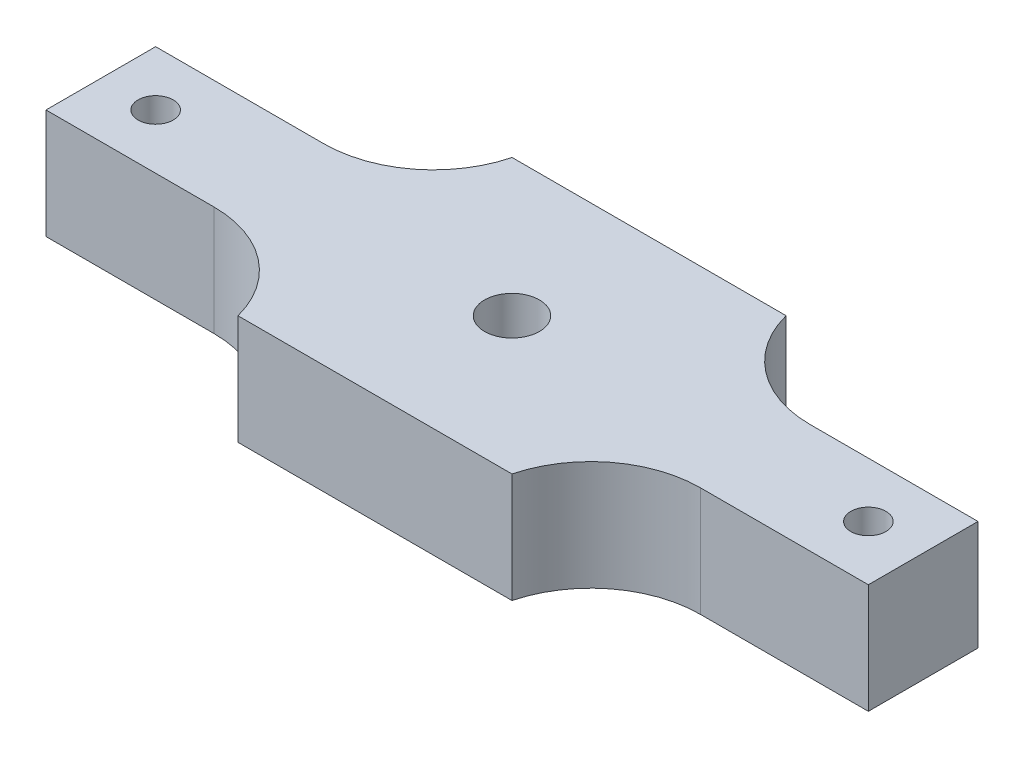
ISO-10303-21;
HEADER;
FILE_DESCRIPTION(('STEP AP214'),'2;1');
FILE_NAME('part.step','',(''),(''),'','','');
FILE_SCHEMA(('AUTOMOTIVE_DESIGN { 1 0 10303 214 1 1 1 1 }'));
ENDSEC;
DATA;
#1=APPLICATION_CONTEXT('core data for automotive mechanical design processes');
#2=APPLICATION_PROTOCOL_DEFINITION('international standard','automotive_design',2000,#1);
#3=PRODUCT_CONTEXT('',#1,'mechanical');
#4=PRODUCT('Part','Part','',(#3));
#5=PRODUCT_RELATED_PRODUCT_CATEGORY('part','',(#4));
#6=PRODUCT_DEFINITION_FORMATION('','',#4);
#7=PRODUCT_DEFINITION_CONTEXT('part definition',#1,'design');
#8=PRODUCT_DEFINITION('design','',#6,#7);
#9=PRODUCT_DEFINITION_SHAPE('','',#8);
#10=(LENGTH_UNIT() NAMED_UNIT(*) SI_UNIT(.MILLI.,.METRE.));
#11=(NAMED_UNIT(*) PLANE_ANGLE_UNIT() SI_UNIT($,.RADIAN.));
#12=(NAMED_UNIT(*) SI_UNIT($,.STERADIAN.) SOLID_ANGLE_UNIT());
#13=UNCERTAINTY_MEASURE_WITH_UNIT(LENGTH_MEASURE(1.E-05),#10,'distance_accuracy_value','');
#14=(GEOMETRIC_REPRESENTATION_CONTEXT(3) GLOBAL_UNCERTAINTY_ASSIGNED_CONTEXT((#13)) GLOBAL_UNIT_ASSIGNED_CONTEXT((#10,
#11,#12)) REPRESENTATION_CONTEXT('',''));
#15=CARTESIAN_POINT('',(0.,0.,0.));
#16=DIRECTION('',(0.,0.,1.));
#17=DIRECTION('',(1.,0.,0.));
#18=AXIS2_PLACEMENT_3D('',#15,#16,#17);
#19=CARTESIAN_POINT('',(0.,5.,16.0911769862675));
#20=DIRECTION('',(0.,0.,-1.));
#21=DIRECTION('',(-1.,0.,0.));
#22=AXIS2_PLACEMENT_3D('',#19,#20,#21);
#23=PLANE('',#22);
#24=DIRECTION('',(1.,0.,0.));
#25=VECTOR('',#24,1.);
#26=CARTESIAN_POINT('',(0.,-5.,16.0911769862675));
#27=LINE('',#26,#25);
#28=CARTESIAN_POINT('',(-55.4594317664236,-5.,16.0911769862675));
#29=VERTEX_POINT('',#28);
#30=CARTESIAN_POINT('',(-40.1342882080935,-5.,16.0911769862675));
#31=VERTEX_POINT('',#30);
#32=EDGE_CURVE('E273',#29,#31,#27,.T.);
#33=ORIENTED_EDGE('',*,*,#32,.T.);
#34=DIRECTION('',(0.,1.,0.));
#35=VECTOR('',#34,1.);
#36=CARTESIAN_POINT('',(-40.1342882080935,5.,16.0911769862675));
#37=LINE('',#36,#35);
#38=CARTESIAN_POINT('',(-40.1342882080935,5.,16.0911769862675));
#39=VERTEX_POINT('',#38);
#40=EDGE_CURVE('E163',#31,#39,#37,.T.);
#41=ORIENTED_EDGE('',*,*,#40,.T.);
#42=DIRECTION('',(1.,0.,0.));
#43=VECTOR('',#42,1.);
#44=CARTESIAN_POINT('',(0.,5.,16.0911769862675));
#45=LINE('',#44,#43);
#46=CARTESIAN_POINT('',(-55.4594317664236,5.,16.0911769862675));
#47=VERTEX_POINT('',#46);
#48=EDGE_CURVE('E136',#47,#39,#45,.T.);
#49=ORIENTED_EDGE('',*,*,#48,.F.);
#50=DIRECTION('',(0.,-1.,0.));
#51=VECTOR('',#50,1.);
#52=CARTESIAN_POINT('',(-55.4594317664236,5.,16.0911769862675));
#53=LINE('',#52,#51);
#54=EDGE_CURVE('E217',#47,#29,#53,.T.);
#55=ORIENTED_EDGE('',*,*,#54,.T.);
#56=EDGE_LOOP('',(#33,#41,#49,#55));
#57=FACE_BOUND('',#56,.T.);
#58=ADVANCED_FACE('F41',(#57),#23,.F.);
#59=CARTESIAN_POINT('',(0.,5.,23.5911769862675));
#60=DIRECTION('',(0.,0.,-1.));
#61=DIRECTION('',(-1.,0.,0.));
#62=AXIS2_PLACEMENT_3D('',#59,#60,#61);
#63=PLANE('',#62);
#64=DIRECTION('',(1.,0.,0.));
#65=VECTOR('',#64,1.);
#66=CARTESIAN_POINT('',(0.,-5.,23.5911769862675));
#67=LINE('',#66,#65);
#68=CARTESIAN_POINT('',(-30.451829842575,-5.,23.5911769862675));
#69=VERTEX_POINT('',#68);
#70=CARTESIAN_POINT('',(-5.45943176642362,-5.,23.5911769862675));
#71=VERTEX_POINT('',#70);
#72=EDGE_CURVE('E245',#69,#71,#67,.T.);
#73=ORIENTED_EDGE('',*,*,#72,.T.);
#74=DIRECTION('',(0.,-1.,0.));
#75=VECTOR('',#74,1.);
#76=CARTESIAN_POINT('',(-5.45943176642362,5.,23.5911769862675));
#77=LINE('',#76,#75);
#78=CARTESIAN_POINT('',(-5.45943176642362,5.,23.5911769862675));
#79=VERTEX_POINT('',#78);
#80=EDGE_CURVE('E151',#79,#71,#77,.T.);
#81=ORIENTED_EDGE('',*,*,#80,.F.);
#82=DIRECTION('',(1.,0.,0.));
#83=VECTOR('',#82,1.);
#84=CARTESIAN_POINT('',(0.,5.,23.5911769862675));
#85=LINE('',#84,#83);
#86=CARTESIAN_POINT('',(-30.451829842575,5.,23.5911769862675));
#87=VERTEX_POINT('',#86);
#88=EDGE_CURVE('E133',#87,#79,#85,.T.);
#89=ORIENTED_EDGE('',*,*,#88,.F.);
#90=DIRECTION('',(0.,-1.,0.));
#91=VECTOR('',#90,1.);
#92=CARTESIAN_POINT('',(-30.451829842575,5.,23.5911769862675));
#93=LINE('',#92,#91);
#94=EDGE_CURVE('E148',#87,#69,#93,.T.);
#95=ORIENTED_EDGE('',*,*,#94,.T.);
#96=EDGE_LOOP('',(#73,#81,#89,#95));
#97=FACE_BOUND('',#96,.T.);
#98=ADVANCED_FACE('F147',(#97),#63,.F.);
#99=CARTESIAN_POINT('',(0.,5.,16.0911769862675));
#100=DIRECTION('',(0.,0.,-1.));
#101=DIRECTION('',(-1.,0.,0.));
#102=AXIS2_PLACEMENT_3D('',#99,#100,#101);
#103=PLANE('',#102);
#104=DIRECTION('',(1.,0.,0.));
#105=VECTOR('',#104,1.);
#106=CARTESIAN_POINT('',(0.,5.,16.0911769862675));
#107=LINE('',#106,#105);
#108=CARTESIAN_POINT('',(4.22302659909492,5.,16.0911769862675));
#109=VERTEX_POINT('',#108);
#110=CARTESIAN_POINT('',(19.5405682335764,5.,16.0911769862675));
#111=VERTEX_POINT('',#110);
#112=EDGE_CURVE('E154',#109,#111,#107,.T.);
#113=ORIENTED_EDGE('',*,*,#112,.F.);
#114=DIRECTION('',(0.,1.,0.));
#115=VECTOR('',#114,1.);
#116=CARTESIAN_POINT('',(4.22302659909492,5.,16.0911769862675));
#117=LINE('',#116,#115);
#118=CARTESIAN_POINT('',(4.22302659909492,-5.,16.0911769862675));
#119=VERTEX_POINT('',#118);
#120=EDGE_CURVE('E158',#109,#119,#117,.F.);
#121=ORIENTED_EDGE('',*,*,#120,.T.);
#122=DIRECTION('',(1.,0.,0.));
#123=VECTOR('',#122,1.);
#124=CARTESIAN_POINT('',(0.,-5.,16.0911769862675));
#125=LINE('',#124,#123);
#126=CARTESIAN_POINT('',(19.5405682335764,-5.,16.0911769862675));
#127=VERTEX_POINT('',#126);
#128=EDGE_CURVE('E238',#119,#127,#125,.T.);
#129=ORIENTED_EDGE('',*,*,#128,.T.);
#130=DIRECTION('',(0.,-1.,0.));
#131=VECTOR('',#130,1.);
#132=CARTESIAN_POINT('',(19.5405682335764,5.,16.0911769862675));
#133=LINE('',#132,#131);
#134=EDGE_CURVE('E165',#111,#127,#133,.T.);
#135=ORIENTED_EDGE('',*,*,#134,.F.);
#136=EDGE_LOOP('',(#113,#121,#129,#135));
#137=FACE_BOUND('',#136,.T.);
#138=ADVANCED_FACE('F280',(#137),#103,.F.);
#139=CARTESIAN_POINT('',(19.5405682335764,5.,0.));
#140=DIRECTION('',(1.,0.,0.));
#141=DIRECTION('',(0.,0.,-1.));
#142=AXIS2_PLACEMENT_3D('',#139,#140,#141);
#143=PLANE('',#142);
#144=DIRECTION('',(0.,0.,1.));
#145=VECTOR('',#144,1.);
#146=CARTESIAN_POINT('',(19.5405682335764,-5.,0.));
#147=LINE('',#146,#145);
#148=CARTESIAN_POINT('',(19.5405682335764,-5.,6.0911769862675));
#149=VERTEX_POINT('',#148);
#150=EDGE_CURVE('E232',#149,#127,#147,.T.);
#151=ORIENTED_EDGE('',*,*,#150,.F.);
#152=DIRECTION('',(0.,-1.,0.));
#153=VECTOR('',#152,1.);
#154=CARTESIAN_POINT('',(19.5405682335764,5.,6.0911769862675));
#155=LINE('',#154,#153);
#156=CARTESIAN_POINT('',(19.5405682335764,5.,6.0911769862675));
#157=VERTEX_POINT('',#156);
#158=EDGE_CURVE('E215',#157,#149,#155,.T.);
#159=ORIENTED_EDGE('',*,*,#158,.F.);
#160=DIRECTION('',(0.,0.,1.));
#161=VECTOR('',#160,1.);
#162=CARTESIAN_POINT('',(19.5405682335764,5.,0.));
#163=LINE('',#162,#161);
#164=EDGE_CURVE('E234',#157,#111,#163,.T.);
#165=ORIENTED_EDGE('',*,*,#164,.T.);
#166=ORIENTED_EDGE('',*,*,#134,.T.);
#167=EDGE_LOOP('',(#151,#159,#165,#166));
#168=FACE_BOUND('',#167,.T.);
#169=ADVANCED_FACE('F230',(#168),#143,.T.);
#170=CARTESIAN_POINT('',(0.,5.,6.0911769862675));
#171=DIRECTION('',(0.,0.,-1.));
#172=DIRECTION('',(-1.,0.,0.));
#173=AXIS2_PLACEMENT_3D('',#170,#171,#172);
#174=PLANE('',#173);
#175=DIRECTION('',(1.,0.,0.));
#176=VECTOR('',#175,1.);
#177=CARTESIAN_POINT('',(0.,-5.,6.0911769862675));
#178=LINE('',#177,#176);
#179=CARTESIAN_POINT('',(4.22302659909492,-5.,6.0911769862675));
#180=VERTEX_POINT('',#179);
#181=EDGE_CURVE('E208',#180,#149,#178,.T.);
#182=ORIENTED_EDGE('',*,*,#181,.F.);
#183=DIRECTION('',(0.,-1.,0.));
#184=VECTOR('',#183,1.);
#185=CARTESIAN_POINT('',(4.22302659909492,5.,6.0911769862675));
#186=LINE('',#185,#184);
#187=CARTESIAN_POINT('',(4.22302659909492,5.,6.0911769862675));
#188=VERTEX_POINT('',#187);
#189=EDGE_CURVE('E171',#180,#188,#186,.F.);
#190=ORIENTED_EDGE('',*,*,#189,.T.);
#191=DIRECTION('',(1.,0.,0.));
#192=VECTOR('',#191,1.);
#193=CARTESIAN_POINT('',(0.,5.,6.0911769862675));
#194=LINE('',#193,#192);
#195=EDGE_CURVE('E284',#188,#157,#194,.T.);
#196=ORIENTED_EDGE('',*,*,#195,.T.);
#197=ORIENTED_EDGE('',*,*,#158,.T.);
#198=EDGE_LOOP('',(#182,#190,#196,#197));
#199=FACE_BOUND('',#198,.T.);
#200=ADVANCED_FACE('F295',(#199),#174,.T.);
#201=CARTESIAN_POINT('',(0.,5.,-1.4088230137325));
#202=DIRECTION('',(0.,0.,-1.));
#203=DIRECTION('',(-1.,0.,0.));
#204=AXIS2_PLACEMENT_3D('',#201,#202,#203);
#205=PLANE('',#204);
#206=DIRECTION('',(1.,0.,0.));
#207=VECTOR('',#206,1.);
#208=CARTESIAN_POINT('',(0.,-5.,-1.4088230137325));
#209=LINE('',#208,#207);
#210=CARTESIAN_POINT('',(-30.451829842575,-5.,-1.4088230137325));
#211=VERTEX_POINT('',#210);
#212=CARTESIAN_POINT('',(-5.45943176642363,-5.,-1.4088230137325));
#213=VERTEX_POINT('',#212);
#214=EDGE_CURVE('E196',#211,#213,#209,.T.);
#215=ORIENTED_EDGE('',*,*,#214,.F.);
#216=DIRECTION('',(0.,-1.,0.));
#217=VECTOR('',#216,1.);
#218=CARTESIAN_POINT('',(-30.451829842575,5.,-1.4088230137325));
#219=LINE('',#218,#217);
#220=CARTESIAN_POINT('',(-30.451829842575,5.,-1.4088230137325));
#221=VERTEX_POINT('',#220);
#222=EDGE_CURVE('E204',#221,#211,#219,.T.);
#223=ORIENTED_EDGE('',*,*,#222,.F.);
#224=DIRECTION('',(1.,0.,0.));
#225=VECTOR('',#224,1.);
#226=CARTESIAN_POINT('',(0.,5.,-1.4088230137325));
#227=LINE('',#226,#225);
#228=CARTESIAN_POINT('',(-5.45943176642363,5.,-1.4088230137325));
#229=VERTEX_POINT('',#228);
#230=EDGE_CURVE('E265',#221,#229,#227,.T.);
#231=ORIENTED_EDGE('',*,*,#230,.T.);
#232=DIRECTION('',(0.,-1.,0.));
#233=VECTOR('',#232,1.);
#234=CARTESIAN_POINT('',(-5.45943176642363,5.,-1.4088230137325));
#235=LINE('',#234,#233);
#236=EDGE_CURVE('E206',#229,#213,#235,.T.);
#237=ORIENTED_EDGE('',*,*,#236,.T.);
#238=EDGE_LOOP('',(#215,#223,#231,#237));
#239=FACE_BOUND('',#238,.T.);
#240=ADVANCED_FACE('F202',(#239),#205,.T.);
#241=CARTESIAN_POINT('',(0.,5.,6.0911769862675));
#242=DIRECTION('',(0.,0.,-1.));
#243=DIRECTION('',(-1.,0.,0.));
#244=AXIS2_PLACEMENT_3D('',#241,#242,#243);
#245=PLANE('',#244);
#246=DIRECTION('',(1.,0.,0.));
#247=VECTOR('',#246,1.);
#248=CARTESIAN_POINT('',(0.,5.,6.0911769862675));
#249=LINE('',#248,#247);
#250=CARTESIAN_POINT('',(-55.4594317664236,5.,6.0911769862675));
#251=VERTEX_POINT('',#250);
#252=CARTESIAN_POINT('',(-40.1342882080935,5.,6.0911769862675));
#253=VERTEX_POINT('',#252);
#254=EDGE_CURVE('E261',#251,#253,#249,.T.);
#255=ORIENTED_EDGE('',*,*,#254,.T.);
#256=DIRECTION('',(0.,1.,0.));
#257=VECTOR('',#256,1.);
#258=CARTESIAN_POINT('',(-40.1342882080935,-5.,6.0911769862675));
#259=LINE('',#258,#257);
#260=CARTESIAN_POINT('',(-40.1342882080935,-5.,6.0911769862675));
#261=VERTEX_POINT('',#260);
#262=EDGE_CURVE('E174',#253,#261,#259,.F.);
#263=ORIENTED_EDGE('',*,*,#262,.T.);
#264=DIRECTION('',(1.,0.,0.));
#265=VECTOR('',#264,1.);
#266=CARTESIAN_POINT('',(0.,-5.,6.0911769862675));
#267=LINE('',#266,#265);
#268=CARTESIAN_POINT('',(-55.4594317664236,-5.,6.0911769862675));
#269=VERTEX_POINT('',#268);
#270=EDGE_CURVE('E199',#269,#261,#267,.T.);
#271=ORIENTED_EDGE('',*,*,#270,.F.);
#272=DIRECTION('',(0.,-1.,0.));
#273=VECTOR('',#272,1.);
#274=CARTESIAN_POINT('',(-55.4594317664236,5.,6.0911769862675));
#275=LINE('',#274,#273);
#276=EDGE_CURVE('E211',#251,#269,#275,.T.);
#277=ORIENTED_EDGE('',*,*,#276,.F.);
#278=EDGE_LOOP('',(#255,#263,#271,#277));
#279=FACE_BOUND('',#278,.T.);
#280=ADVANCED_FACE('F303',(#279),#245,.T.);
#281=CARTESIAN_POINT('',(-17.9594317664236,5.,11.0911769862675));
#282=DIRECTION('',(0.,-1.,0.));
#283=DIRECTION('',(0.,0.,-1.));
#284=AXIS2_PLACEMENT_3D('',#281,#282,#283);
#285=CYLINDRICAL_SURFACE('',#284,2.5);
#286=CARTESIAN_POINT('',(-17.9594317664236,5.,11.0911769862675));
#287=DIRECTION('',(0.,1.,0.));
#288=DIRECTION('',(0.,0.,1.));
#289=AXIS2_PLACEMENT_3D('',#286,#287,#288);
#290=CIRCLE('',#289,2.5);
#291=CARTESIAN_POINT('',(-17.9594317664236,5.,13.5911769862675));
#292=VERTEX_POINT('',#291);
#293=EDGE_CURVE('E253',#292,#292,#290,.T.);
#294=ORIENTED_EDGE('',*,*,#293,.T.);
#295=EDGE_LOOP('',(#294));
#296=FACE_BOUND('',#295,.T.);
#297=CARTESIAN_POINT('',(-17.9594317664236,-5.,11.0911769862675));
#298=DIRECTION('',(0.,1.,0.));
#299=DIRECTION('',(0.,0.,1.));
#300=AXIS2_PLACEMENT_3D('',#297,#298,#299);
#301=CIRCLE('',#300,2.5);
#302=CARTESIAN_POINT('',(-17.9594317664236,-5.,13.5911769862675));
#303=VERTEX_POINT('',#302);
#304=EDGE_CURVE('E269',#303,#303,#301,.T.);
#305=ORIENTED_EDGE('',*,*,#304,.F.);
#306=EDGE_LOOP('',(#305));
#307=FACE_BOUND('',#306,.T.);
#308=ADVANCED_FACE('F314',(#296,#307),#285,.F.);
#309=CARTESIAN_POINT('',(-55.4594317664236,5.,0.));
#310=DIRECTION('',(1.,0.,0.));
#311=DIRECTION('',(0.,0.,-1.));
#312=AXIS2_PLACEMENT_3D('',#309,#310,#311);
#313=PLANE('',#312);
#314=DIRECTION('',(0.,0.,1.));
#315=VECTOR('',#314,1.);
#316=CARTESIAN_POINT('',(-55.4594317664236,-5.,0.));
#317=LINE('',#316,#315);
#318=EDGE_CURVE('E251',#269,#29,#317,.T.);
#319=ORIENTED_EDGE('',*,*,#318,.T.);
#320=ORIENTED_EDGE('',*,*,#54,.F.);
#321=DIRECTION('',(0.,0.,1.));
#322=VECTOR('',#321,1.);
#323=CARTESIAN_POINT('',(-55.4594317664236,5.,0.));
#324=LINE('',#323,#322);
#325=EDGE_CURVE('E256',#251,#47,#324,.T.);
#326=ORIENTED_EDGE('',*,*,#325,.F.);
#327=ORIENTED_EDGE('',*,*,#276,.T.);
#328=EDGE_LOOP('',(#319,#320,#326,#327));
#329=FACE_BOUND('',#328,.T.);
#330=ADVANCED_FACE('F317',(#329),#313,.F.);
#331=CARTESIAN_POINT('',(0.,5.,0.));
#332=DIRECTION('',(0.,1.,0.));
#333=DIRECTION('',(0.,0.,1.));
#334=AXIS2_PLACEMENT_3D('',#331,#332,#333);
#335=PLANE('',#334);
#336=CARTESIAN_POINT('',(14.5405682335764,5.,11.0911769862675));
#337=DIRECTION('',(0.,1.,0.));
#338=DIRECTION('',(0.,0.,1.));
#339=AXIS2_PLACEMENT_3D('',#336,#337,#338);
#340=CIRCLE('',#339,1.59999999999999);
#341=CARTESIAN_POINT('',(14.5405682335764,5.,12.6911769862675));
#342=VERTEX_POINT('',#341);
#343=EDGE_CURVE('E370',#342,#342,#340,.T.);
#344=ORIENTED_EDGE('',*,*,#343,.F.);
#345=EDGE_LOOP('',(#344));
#346=FACE_BOUND('',#345,.T.);
#347=CARTESIAN_POINT('',(-50.4594317664236,5.,11.0911769862675));
#348=DIRECTION('',(0.,1.,0.));
#349=DIRECTION('',(0.,0.,1.));
#350=AXIS2_PLACEMENT_3D('',#347,#348,#349);
#351=CIRCLE('',#350,1.59999999999998);
#352=CARTESIAN_POINT('',(-50.4594317664236,5.,12.6911769862675));
#353=VERTEX_POINT('',#352);
#354=EDGE_CURVE('E362',#353,#353,#351,.T.);
#355=ORIENTED_EDGE('',*,*,#354,.F.);
#356=EDGE_LOOP('',(#355));
#357=FACE_BOUND('',#356,.T.);
#358=ORIENTED_EDGE('',*,*,#293,.F.);
#359=EDGE_LOOP('',(#358));
#360=FACE_BOUND('',#359,.T.);
#361=ORIENTED_EDGE('',*,*,#48,.T.);
#362=CARTESIAN_POINT('',(-40.1342882080935,5.,26.0911769862675));
#363=DIRECTION('',(0.,1.,0.));
#364=DIRECTION('',(0.,0.,1.));
#365=AXIS2_PLACEMENT_3D('',#362,#363,#364);
#366=CIRCLE('',#365,10.);
#367=EDGE_CURVE('E130',#39,#87,#366,.F.);
#368=ORIENTED_EDGE('',*,*,#367,.T.);
#369=ORIENTED_EDGE('',*,*,#88,.T.);
#370=CARTESIAN_POINT('',(4.22302659909492,5.,26.0911769862675));
#371=DIRECTION('',(0.,1.,0.));
#372=DIRECTION('',(0.,0.,1.));
#373=AXIS2_PLACEMENT_3D('',#370,#371,#372);
#374=CIRCLE('',#373,10.);
#375=EDGE_CURVE('E180',#79,#109,#374,.F.);
#376=ORIENTED_EDGE('',*,*,#375,.T.);
#377=ORIENTED_EDGE('',*,*,#112,.T.);
#378=ORIENTED_EDGE('',*,*,#164,.F.);
#379=ORIENTED_EDGE('',*,*,#195,.F.);
#380=CARTESIAN_POINT('',(4.22302659909492,5.,-3.9088230137325));
#381=DIRECTION('',(0.,1.,0.));
#382=DIRECTION('',(0.,0.,1.));
#383=AXIS2_PLACEMENT_3D('',#380,#381,#382);
#384=CIRCLE('',#383,10.);
#385=EDGE_CURVE('E187',#188,#229,#384,.F.);
#386=ORIENTED_EDGE('',*,*,#385,.T.);
#387=ORIENTED_EDGE('',*,*,#230,.F.);
#388=CARTESIAN_POINT('',(-40.1342882080935,5.,-3.9088230137325));
#389=DIRECTION('',(0.,1.,0.));
#390=DIRECTION('',(0.,0.,1.));
#391=AXIS2_PLACEMENT_3D('',#388,#389,#390);
#392=CIRCLE('',#391,10.);
#393=EDGE_CURVE('E11',#221,#253,#392,.F.);
#394=ORIENTED_EDGE('',*,*,#393,.T.);
#395=ORIENTED_EDGE('',*,*,#254,.F.);
#396=ORIENTED_EDGE('',*,*,#325,.T.);
#397=EDGE_LOOP('',(#361,#368,#369,#376,#377,#378,#379,#386,#387,#394,#395,#396));
#398=FACE_BOUND('',#397,.T.);
#399=ADVANCED_FACE('F132',(#346,#357,#360,#398),#335,.T.);
#400=CARTESIAN_POINT('',(0.,-5.,0.));
#401=DIRECTION('',(0.,1.,0.));
#402=DIRECTION('',(0.,0.,1.));
#403=AXIS2_PLACEMENT_3D('',#400,#401,#402);
#404=PLANE('',#403);
#405=CARTESIAN_POINT('',(14.5405682335764,-5.,11.0911769862675));
#406=DIRECTION('',(0.,1.,0.));
#407=DIRECTION('',(0.,0.,1.));
#408=AXIS2_PLACEMENT_3D('',#405,#406,#407);
#409=CIRCLE('',#408,1.6);
#410=CARTESIAN_POINT('',(14.5405682335764,-5.,12.6911769862675));
#411=VERTEX_POINT('',#410);
#412=EDGE_CURVE('E366',#411,#411,#409,.T.);
#413=ORIENTED_EDGE('',*,*,#412,.T.);
#414=EDGE_LOOP('',(#413));
#415=FACE_BOUND('',#414,.T.);
#416=CARTESIAN_POINT('',(-50.4594317664236,-5.,11.0911769862675));
#417=DIRECTION('',(0.,1.,0.));
#418=DIRECTION('',(0.,0.,1.));
#419=AXIS2_PLACEMENT_3D('',#416,#417,#418);
#420=CIRCLE('',#419,1.6);
#421=CARTESIAN_POINT('',(-50.4594317664236,-5.,12.6911769862675));
#422=VERTEX_POINT('',#421);
#423=EDGE_CURVE('E274',#422,#422,#420,.T.);
#424=ORIENTED_EDGE('',*,*,#423,.T.);
#425=EDGE_LOOP('',(#424));
#426=FACE_BOUND('',#425,.T.);
#427=ORIENTED_EDGE('',*,*,#304,.T.);
#428=EDGE_LOOP('',(#427));
#429=FACE_BOUND('',#428,.T.);
#430=ORIENTED_EDGE('',*,*,#32,.F.);
#431=ORIENTED_EDGE('',*,*,#318,.F.);
#432=ORIENTED_EDGE('',*,*,#270,.T.);
#433=CARTESIAN_POINT('',(-40.1342882080935,-5.,-3.9088230137325));
#434=DIRECTION('',(0.,1.,0.));
#435=DIRECTION('',(0.,0.,1.));
#436=AXIS2_PLACEMENT_3D('',#433,#434,#435);
#437=CIRCLE('',#436,10.);
#438=EDGE_CURVE('E50',#261,#211,#437,.T.);
#439=ORIENTED_EDGE('',*,*,#438,.T.);
#440=ORIENTED_EDGE('',*,*,#214,.T.);
#441=CARTESIAN_POINT('',(4.22302659909492,-5.,-3.9088230137325));
#442=DIRECTION('',(0.,1.,0.));
#443=DIRECTION('',(0.,0.,1.));
#444=AXIS2_PLACEMENT_3D('',#441,#442,#443);
#445=CIRCLE('',#444,10.);
#446=EDGE_CURVE('E141',#213,#180,#445,.T.);
#447=ORIENTED_EDGE('',*,*,#446,.T.);
#448=ORIENTED_EDGE('',*,*,#181,.T.);
#449=ORIENTED_EDGE('',*,*,#150,.T.);
#450=ORIENTED_EDGE('',*,*,#128,.F.);
#451=CARTESIAN_POINT('',(4.22302659909492,-5.,26.0911769862675));
#452=DIRECTION('',(0.,1.,0.));
#453=DIRECTION('',(0.,0.,1.));
#454=AXIS2_PLACEMENT_3D('',#451,#452,#453);
#455=CIRCLE('',#454,10.);
#456=EDGE_CURVE('E177',#119,#71,#455,.T.);
#457=ORIENTED_EDGE('',*,*,#456,.T.);
#458=ORIENTED_EDGE('',*,*,#72,.F.);
#459=CARTESIAN_POINT('',(-40.1342882080935,-5.,26.0911769862675));
#460=DIRECTION('',(0.,1.,0.));
#461=DIRECTION('',(0.,0.,1.));
#462=AXIS2_PLACEMENT_3D('',#459,#460,#461);
#463=CIRCLE('',#462,10.);
#464=EDGE_CURVE('E142',#69,#31,#463,.T.);
#465=ORIENTED_EDGE('',*,*,#464,.T.);
#466=EDGE_LOOP('',(#430,#431,#432,#439,#440,#447,#448,#449,#450,#457,#458,#465));
#467=FACE_BOUND('',#466,.T.);
#468=ADVANCED_FACE('F195',(#415,#426,#429,#467),#404,.F.);
#469=CARTESIAN_POINT('',(4.22302659909492,5.,26.0911769862675));
#470=DIRECTION('',(0.,1.,0.));
#471=DIRECTION('',(0.,0.,1.));
#472=AXIS2_PLACEMENT_3D('',#469,#470,#471);
#473=CYLINDRICAL_SURFACE('',#472,10.);
#474=ORIENTED_EDGE('',*,*,#375,.F.);
#475=ORIENTED_EDGE('',*,*,#80,.T.);
#476=ORIENTED_EDGE('',*,*,#456,.F.);
#477=ORIENTED_EDGE('',*,*,#120,.F.);
#478=EDGE_LOOP('',(#474,#475,#476,#477));
#479=FACE_BOUND('',#478,.T.);
#480=ADVANCED_FACE('F278',(#479),#473,.F.);
#481=CARTESIAN_POINT('',(-40.1342882080935,5.,26.0911769862675));
#482=DIRECTION('',(0.,1.,0.));
#483=DIRECTION('',(0.,0.,1.));
#484=AXIS2_PLACEMENT_3D('',#481,#482,#483);
#485=CYLINDRICAL_SURFACE('',#484,10.);
#486=ORIENTED_EDGE('',*,*,#367,.F.);
#487=ORIENTED_EDGE('',*,*,#40,.F.);
#488=ORIENTED_EDGE('',*,*,#464,.F.);
#489=ORIENTED_EDGE('',*,*,#94,.F.);
#490=EDGE_LOOP('',(#486,#487,#488,#489));
#491=FACE_BOUND('',#490,.T.);
#492=ADVANCED_FACE('F156',(#491),#485,.F.);
#493=CARTESIAN_POINT('',(4.22302659909492,5.,-3.9088230137325));
#494=DIRECTION('',(0.,1.,0.));
#495=DIRECTION('',(0.,0.,1.));
#496=AXIS2_PLACEMENT_3D('',#493,#494,#495);
#497=CYLINDRICAL_SURFACE('',#496,10.);
#498=ORIENTED_EDGE('',*,*,#385,.F.);
#499=ORIENTED_EDGE('',*,*,#189,.F.);
#500=ORIENTED_EDGE('',*,*,#446,.F.);
#501=ORIENTED_EDGE('',*,*,#236,.F.);
#502=EDGE_LOOP('',(#498,#499,#500,#501));
#503=FACE_BOUND('',#502,.T.);
#504=ADVANCED_FACE('F292',(#503),#497,.F.);
#505=CARTESIAN_POINT('',(-40.1342882080935,5.,-3.9088230137325));
#506=DIRECTION('',(0.,-1.,0.));
#507=DIRECTION('',(0.,0.,-1.));
#508=AXIS2_PLACEMENT_3D('',#505,#506,#507);
#509=CYLINDRICAL_SURFACE('',#508,10.);
#510=ORIENTED_EDGE('',*,*,#393,.F.);
#511=ORIENTED_EDGE('',*,*,#222,.T.);
#512=ORIENTED_EDGE('',*,*,#438,.F.);
#513=ORIENTED_EDGE('',*,*,#262,.F.);
#514=EDGE_LOOP('',(#510,#511,#512,#513));
#515=FACE_BOUND('',#514,.T.);
#516=ADVANCED_FACE('F43',(#515),#509,.F.);
#517=CARTESIAN_POINT('',(-50.4594317664236,5.,11.0911769862675));
#518=DIRECTION('',(0.,1.,0.));
#519=DIRECTION('',(0.,0.,1.));
#520=AXIS2_PLACEMENT_3D('',#517,#518,#519);
#521=CYLINDRICAL_SURFACE('',#520,1.59999999999999);
#522=ORIENTED_EDGE('',*,*,#423,.F.);
#523=EDGE_LOOP('',(#522));
#524=FACE_BOUND('',#523,.T.);
#525=ORIENTED_EDGE('',*,*,#354,.T.);
#526=EDGE_LOOP('',(#525));
#527=FACE_BOUND('',#526,.T.);
#528=ADVANCED_FACE('F326',(#524,#527),#521,.F.);
#529=CARTESIAN_POINT('',(14.5405682335764,5.,11.0911769862675));
#530=DIRECTION('',(0.,1.,0.));
#531=DIRECTION('',(0.,0.,1.));
#532=AXIS2_PLACEMENT_3D('',#529,#530,#531);
#533=CYLINDRICAL_SURFACE('',#532,1.59999999999999);
#534=ORIENTED_EDGE('',*,*,#412,.F.);
#535=EDGE_LOOP('',(#534));
#536=FACE_BOUND('',#535,.T.);
#537=ORIENTED_EDGE('',*,*,#343,.T.);
#538=EDGE_LOOP('',(#537));
#539=FACE_BOUND('',#538,.T.);
#540=ADVANCED_FACE('F330',(#536,#539),#533,.F.);
#541=CLOSED_SHELL('',(#58,#98,#138,#169,#200,#240,#280,#308,#330,#399,#468,#480,#492,#504,#516,
#528,#540));
#542=MANIFOLD_SOLID_BREP('B2',#541);
#543=ADVANCED_BREP_SHAPE_REPRESENTATION('',(#18,#542),#14);
#544=SHAPE_DEFINITION_REPRESENTATION(#9,#543);
ENDSEC;
END-ISO-10303-21;
